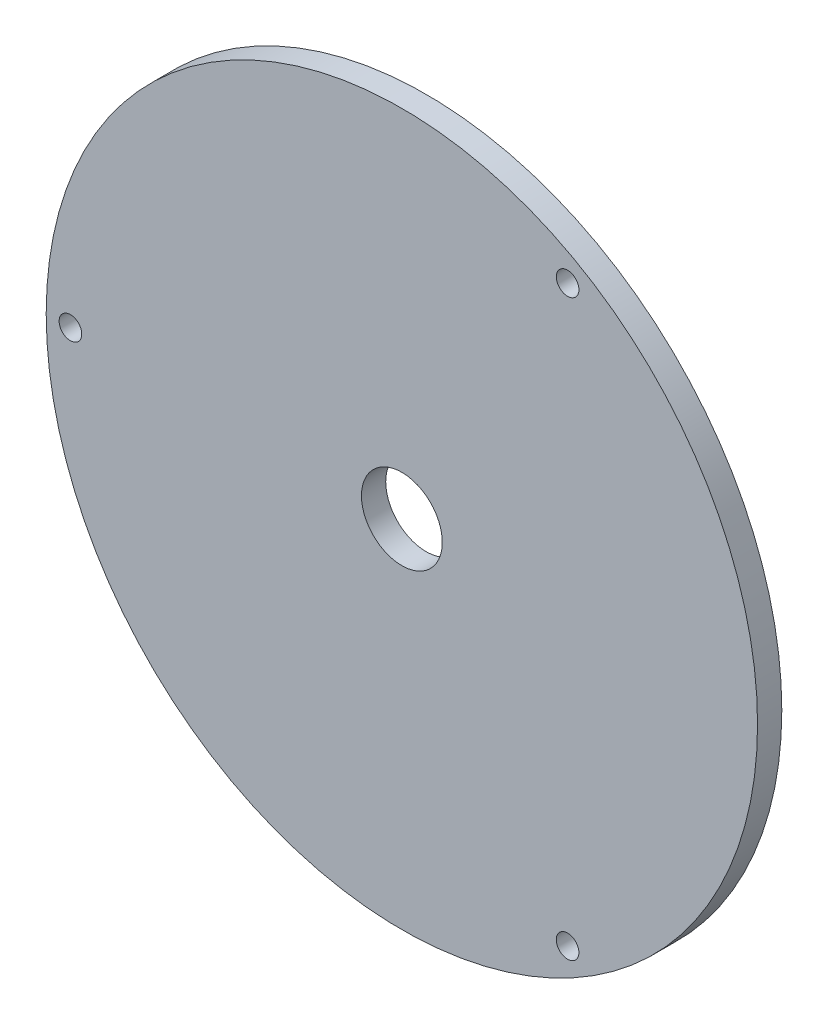
ISO-10303-21;
HEADER;
FILE_DESCRIPTION(('STEP AP214'),'2;1');
FILE_NAME('part.step','',(''),(''),'','','');
FILE_SCHEMA(('AUTOMOTIVE_DESIGN { 1 0 10303 214 1 1 1 1 }'));
ENDSEC;
DATA;
#1=APPLICATION_CONTEXT('core data for automotive mechanical design processes');
#2=APPLICATION_PROTOCOL_DEFINITION('international standard','automotive_design',2000,#1);
#3=PRODUCT_CONTEXT('',#1,'mechanical');
#4=PRODUCT('Part','Part','',(#3));
#5=PRODUCT_RELATED_PRODUCT_CATEGORY('part','',(#4));
#6=PRODUCT_DEFINITION_FORMATION('','',#4);
#7=PRODUCT_DEFINITION_CONTEXT('part definition',#1,'design');
#8=PRODUCT_DEFINITION('design','',#6,#7);
#9=PRODUCT_DEFINITION_SHAPE('','',#8);
#10=(LENGTH_UNIT() NAMED_UNIT(*) SI_UNIT(.MILLI.,.METRE.));
#11=(NAMED_UNIT(*) PLANE_ANGLE_UNIT() SI_UNIT($,.RADIAN.));
#12=(NAMED_UNIT(*) SI_UNIT($,.STERADIAN.) SOLID_ANGLE_UNIT());
#13=UNCERTAINTY_MEASURE_WITH_UNIT(LENGTH_MEASURE(1.E-05),#10,'distance_accuracy_value','');
#14=(GEOMETRIC_REPRESENTATION_CONTEXT(3) GLOBAL_UNCERTAINTY_ASSIGNED_CONTEXT((#13)) GLOBAL_UNIT_ASSIGNED_CONTEXT((#10,
#11,#12)) REPRESENTATION_CONTEXT('',''));
#15=CARTESIAN_POINT('',(0.,0.,0.));
#16=DIRECTION('',(0.,0.,1.));
#17=DIRECTION('',(1.,0.,0.));
#18=AXIS2_PLACEMENT_3D('',#15,#16,#17);
#19=CARTESIAN_POINT('',(0.,0.,1.5));
#20=DIRECTION('',(0.,0.,1.));
#21=DIRECTION('',(1.,0.,0.));
#22=AXIS2_PLACEMENT_3D('',#19,#20,#21);
#23=PLANE('',#22);
#24=CARTESIAN_POINT('',(0.,0.,1.5));
#25=DIRECTION('',(0.,0.,-1.));
#26=DIRECTION('',(-1.,0.,0.));
#27=AXIS2_PLACEMENT_3D('',#24,#25,#26);
#28=CIRCLE('',#27,2.5);
#29=CARTESIAN_POINT('',(-2.5,0.,1.5));
#30=VERTEX_POINT('',#29);
#31=EDGE_CURVE('E64',#30,#30,#28,.T.);
#32=ORIENTED_EDGE('',*,*,#31,.F.);
#33=EDGE_LOOP('',(#32));
#34=FACE_BOUND('',#33,.T.);
#35=CARTESIAN_POINT('',(-20.5,0.,1.5));
#36=DIRECTION('',(0.,0.,-1.));
#37=DIRECTION('',(-1.,0.,0.));
#38=AXIS2_PLACEMENT_3D('',#35,#36,#37);
#39=CIRCLE('',#38,0.699999999999998);
#40=CARTESIAN_POINT('',(-21.2,0.,1.5));
#41=VERTEX_POINT('',#40);
#42=EDGE_CURVE('E59',#41,#41,#39,.T.);
#43=ORIENTED_EDGE('',*,*,#42,.F.);
#44=EDGE_LOOP('',(#43));
#45=FACE_BOUND('',#44,.T.);
#46=CARTESIAN_POINT('',(10.2500000000001,-17.7535207775809,1.5));
#47=DIRECTION('',(0.,0.,-1.));
#48=DIRECTION('',(-1.,0.,0.));
#49=AXIS2_PLACEMENT_3D('',#46,#47,#48);
#50=CIRCLE('',#49,0.699999999999999);
#51=CARTESIAN_POINT('',(9.55000000000009,-17.7535207775809,1.5));
#52=VERTEX_POINT('',#51);
#53=EDGE_CURVE('E53',#52,#52,#50,.T.);
#54=ORIENTED_EDGE('',*,*,#53,.F.);
#55=EDGE_LOOP('',(#54));
#56=FACE_BOUND('',#55,.T.);
#57=CARTESIAN_POINT('',(10.2499999999998,17.7535207775811,1.5));
#58=DIRECTION('',(0.,0.,-1.));
#59=DIRECTION('',(-1.,0.,0.));
#60=AXIS2_PLACEMENT_3D('',#57,#58,#59);
#61=CIRCLE('',#60,0.699999999999999);
#62=CARTESIAN_POINT('',(9.54999999999984,17.7535207775811,1.5));
#63=VERTEX_POINT('',#62);
#64=EDGE_CURVE('E46',#63,#63,#61,.T.);
#65=ORIENTED_EDGE('',*,*,#64,.F.);
#66=EDGE_LOOP('',(#65));
#67=FACE_BOUND('',#66,.T.);
#68=CARTESIAN_POINT('',(0.,0.,1.5));
#69=DIRECTION('',(0.,0.,1.));
#70=DIRECTION('',(1.,0.,0.));
#71=AXIS2_PLACEMENT_3D('',#68,#69,#70);
#72=CIRCLE('',#71,22.);
#73=CARTESIAN_POINT('',(22.,0.,1.5));
#74=VERTEX_POINT('',#73);
#75=EDGE_CURVE('E37',#74,#74,#72,.T.);
#76=ORIENTED_EDGE('',*,*,#75,.F.);
#77=EDGE_LOOP('',(#76));
#78=FACE_BOUND('',#77,.T.);
#79=ADVANCED_FACE('F33',(#34,#45,#56,#67,#78),#23,.F.);
#80=CARTESIAN_POINT('',(0.,0.,3.));
#81=DIRECTION('',(0.,0.,-1.));
#82=DIRECTION('',(-1.,0.,0.));
#83=AXIS2_PLACEMENT_3D('',#80,#81,#82);
#84=CYLINDRICAL_SURFACE('',#83,22.);
#85=CARTESIAN_POINT('',(0.,0.,3.));
#86=DIRECTION('',(0.,0.,1.));
#87=DIRECTION('',(1.,0.,0.));
#88=AXIS2_PLACEMENT_3D('',#85,#86,#87);
#89=CIRCLE('',#88,22.);
#90=CARTESIAN_POINT('',(22.,0.,3.));
#91=VERTEX_POINT('',#90);
#92=EDGE_CURVE('E10',#91,#91,#89,.T.);
#93=ORIENTED_EDGE('',*,*,#92,.F.);
#94=EDGE_LOOP('',(#93));
#95=FACE_BOUND('',#94,.T.);
#96=ORIENTED_EDGE('',*,*,#75,.T.);
#97=EDGE_LOOP('',(#96));
#98=FACE_BOUND('',#97,.T.);
#99=ADVANCED_FACE('F35',(#95,#98),#84,.T.);
#100=CARTESIAN_POINT('',(0.,0.,3.));
#101=DIRECTION('',(0.,0.,1.));
#102=DIRECTION('',(1.,0.,0.));
#103=AXIS2_PLACEMENT_3D('',#100,#101,#102);
#104=PLANE('',#103);
#105=CARTESIAN_POINT('',(0.,0.,3.));
#106=DIRECTION('',(0.,0.,-1.));
#107=DIRECTION('',(-1.,0.,0.));
#108=AXIS2_PLACEMENT_3D('',#105,#106,#107);
#109=CIRCLE('',#108,2.5);
#110=CARTESIAN_POINT('',(-2.5,0.,3.));
#111=VERTEX_POINT('',#110);
#112=EDGE_CURVE('E50',#111,#111,#109,.T.);
#113=ORIENTED_EDGE('',*,*,#112,.T.);
#114=EDGE_LOOP('',(#113));
#115=FACE_BOUND('',#114,.T.);
#116=CARTESIAN_POINT('',(-20.5,0.,3.));
#117=DIRECTION('',(0.,0.,-1.));
#118=DIRECTION('',(-1.,0.,0.));
#119=AXIS2_PLACEMENT_3D('',#116,#117,#118);
#120=CIRCLE('',#119,0.699999999999998);
#121=CARTESIAN_POINT('',(-21.2,0.,3.));
#122=VERTEX_POINT('',#121);
#123=EDGE_CURVE('E44',#122,#122,#120,.T.);
#124=ORIENTED_EDGE('',*,*,#123,.T.);
#125=EDGE_LOOP('',(#124));
#126=FACE_BOUND('',#125,.T.);
#127=CARTESIAN_POINT('',(10.2500000000001,-17.7535207775809,3.));
#128=DIRECTION('',(0.,0.,-1.));
#129=DIRECTION('',(-1.,0.,0.));
#130=AXIS2_PLACEMENT_3D('',#127,#128,#129);
#131=CIRCLE('',#130,0.699999999999999);
#132=CARTESIAN_POINT('',(9.55000000000009,-17.7535207775809,3.));
#133=VERTEX_POINT('',#132);
#134=EDGE_CURVE('E56',#133,#133,#131,.T.);
#135=ORIENTED_EDGE('',*,*,#134,.T.);
#136=EDGE_LOOP('',(#135));
#137=FACE_BOUND('',#136,.T.);
#138=CARTESIAN_POINT('',(10.2499999999998,17.7535207775811,3.));
#139=DIRECTION('',(0.,0.,-1.));
#140=DIRECTION('',(-1.,0.,0.));
#141=AXIS2_PLACEMENT_3D('',#138,#139,#140);
#142=CIRCLE('',#141,0.699999999999999);
#143=CARTESIAN_POINT('',(9.54999999999984,17.7535207775811,3.));
#144=VERTEX_POINT('',#143);
#145=EDGE_CURVE('E49',#144,#144,#142,.T.);
#146=ORIENTED_EDGE('',*,*,#145,.T.);
#147=EDGE_LOOP('',(#146));
#148=FACE_BOUND('',#147,.T.);
#149=ORIENTED_EDGE('',*,*,#92,.T.);
#150=EDGE_LOOP('',(#149));
#151=FACE_BOUND('',#150,.T.);
#152=ADVANCED_FACE('F70',(#115,#126,#137,#148,#151),#104,.T.);
#153=CARTESIAN_POINT('',(10.2499999999998,17.7535207775811,3.));
#154=DIRECTION('',(0.,0.,-1.));
#155=DIRECTION('',(-1.,0.,0.));
#156=AXIS2_PLACEMENT_3D('',#153,#154,#155);
#157=CYLINDRICAL_SURFACE('',#156,0.699999999999999);
#158=ORIENTED_EDGE('',*,*,#145,.F.);
#159=EDGE_LOOP('',(#158));
#160=FACE_BOUND('',#159,.T.);
#161=ORIENTED_EDGE('',*,*,#64,.T.);
#162=EDGE_LOOP('',(#161));
#163=FACE_BOUND('',#162,.T.);
#164=ADVANCED_FACE('F95',(#160,#163),#157,.F.);
#165=CARTESIAN_POINT('',(10.2500000000001,-17.7535207775809,3.));
#166=DIRECTION('',(0.,0.,-1.));
#167=DIRECTION('',(-1.,0.,0.));
#168=AXIS2_PLACEMENT_3D('',#165,#166,#167);
#169=CYLINDRICAL_SURFACE('',#168,0.699999999999999);
#170=ORIENTED_EDGE('',*,*,#134,.F.);
#171=EDGE_LOOP('',(#170));
#172=FACE_BOUND('',#171,.T.);
#173=ORIENTED_EDGE('',*,*,#53,.T.);
#174=EDGE_LOOP('',(#173));
#175=FACE_BOUND('',#174,.T.);
#176=ADVANCED_FACE('F100',(#172,#175),#169,.F.);
#177=CARTESIAN_POINT('',(-20.5,0.,3.));
#178=DIRECTION('',(0.,0.,-1.));
#179=DIRECTION('',(-1.,0.,0.));
#180=AXIS2_PLACEMENT_3D('',#177,#178,#179);
#181=CYLINDRICAL_SURFACE('',#180,0.699999999999998);
#182=ORIENTED_EDGE('',*,*,#123,.F.);
#183=EDGE_LOOP('',(#182));
#184=FACE_BOUND('',#183,.T.);
#185=ORIENTED_EDGE('',*,*,#42,.T.);
#186=EDGE_LOOP('',(#185));
#187=FACE_BOUND('',#186,.T.);
#188=ADVANCED_FACE('F76',(#184,#187),#181,.F.);
#189=CARTESIAN_POINT('',(0.,0.,3.));
#190=DIRECTION('',(0.,0.,-1.));
#191=DIRECTION('',(-1.,0.,0.));
#192=AXIS2_PLACEMENT_3D('',#189,#190,#191);
#193=CYLINDRICAL_SURFACE('',#192,2.5);
#194=ORIENTED_EDGE('',*,*,#112,.F.);
#195=EDGE_LOOP('',(#194));
#196=FACE_BOUND('',#195,.T.);
#197=ORIENTED_EDGE('',*,*,#31,.T.);
#198=EDGE_LOOP('',(#197));
#199=FACE_BOUND('',#198,.T.);
#200=ADVANCED_FACE('F73',(#196,#199),#193,.F.);
#201=CLOSED_SHELL('',(#79,#99,#152,#164,#176,#188,#200));
#202=MANIFOLD_SOLID_BREP('B2',#201);
#203=ADVANCED_BREP_SHAPE_REPRESENTATION('',(#18,#202),#14);
#204=SHAPE_DEFINITION_REPRESENTATION(#9,#203);
ENDSEC;
END-ISO-10303-21;
